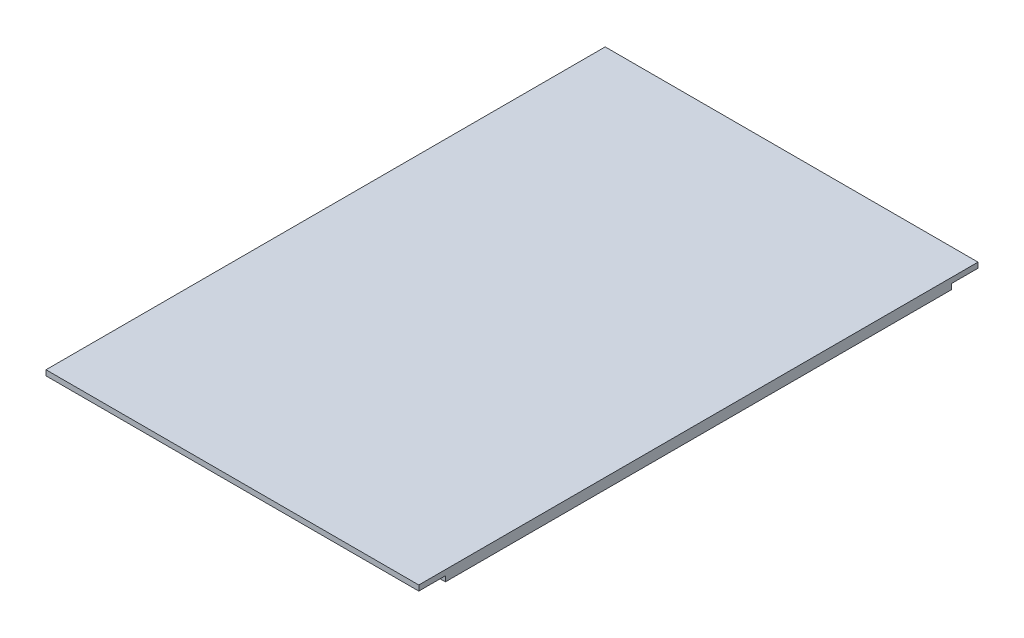
ISO-10303-21;
HEADER;
FILE_DESCRIPTION(('STEP AP214'),'2;1');
FILE_NAME('part.step','',(''),(''),'','','');
FILE_SCHEMA(('AUTOMOTIVE_DESIGN { 1 0 10303 214 1 1 1 1 }'));
ENDSEC;
DATA;
#1=APPLICATION_CONTEXT('core data for automotive mechanical design processes');
#2=APPLICATION_PROTOCOL_DEFINITION('international standard','automotive_design',2000,#1);
#3=PRODUCT_CONTEXT('',#1,'mechanical');
#4=PRODUCT('Part','Part','',(#3));
#5=PRODUCT_RELATED_PRODUCT_CATEGORY('part','',(#4));
#6=PRODUCT_DEFINITION_FORMATION('','',#4);
#7=PRODUCT_DEFINITION_CONTEXT('part definition',#1,'design');
#8=PRODUCT_DEFINITION('design','',#6,#7);
#9=PRODUCT_DEFINITION_SHAPE('','',#8);
#10=(LENGTH_UNIT() NAMED_UNIT(*) SI_UNIT(.MILLI.,.METRE.));
#11=(NAMED_UNIT(*) PLANE_ANGLE_UNIT() SI_UNIT($,.RADIAN.));
#12=(NAMED_UNIT(*) SI_UNIT($,.STERADIAN.) SOLID_ANGLE_UNIT());
#13=UNCERTAINTY_MEASURE_WITH_UNIT(LENGTH_MEASURE(1.E-05),#10,'distance_accuracy_value','');
#14=(GEOMETRIC_REPRESENTATION_CONTEXT(3) GLOBAL_UNCERTAINTY_ASSIGNED_CONTEXT((#13)) GLOBAL_UNIT_ASSIGNED_CONTEXT((#10,
#11,#12)) REPRESENTATION_CONTEXT('',''));
#15=CARTESIAN_POINT('',(0.,0.,0.));
#16=DIRECTION('',(0.,0.,1.));
#17=DIRECTION('',(1.,0.,0.));
#18=AXIS2_PLACEMENT_3D('',#15,#16,#17);
#19=CARTESIAN_POINT('',(0.,29.,-95.));
#20=DIRECTION('',(0.,0.,-1.));
#21=DIRECTION('',(-1.,0.,0.));
#22=AXIS2_PLACEMENT_3D('',#19,#20,#21);
#23=PLANE('',#22);
#24=DIRECTION('',(0.,-1.,0.));
#25=VECTOR('',#24,1.);
#26=CARTESIAN_POINT('',(-70.,29.,-95.));
#27=LINE('',#26,#25);
#28=CARTESIAN_POINT('',(-70.,2.,-95.));
#29=VERTEX_POINT('',#28);
#30=CARTESIAN_POINT('',(-70.,0.,-95.));
#31=VERTEX_POINT('',#30);
#32=EDGE_CURVE('E166',#29,#31,#27,.T.);
#33=ORIENTED_EDGE('',*,*,#32,.F.);
#34=DIRECTION('',(1.,0.,0.));
#35=VECTOR('',#34,1.);
#36=CARTESIAN_POINT('',(-70.,2.,-95.));
#37=LINE('',#36,#35);
#38=CARTESIAN_POINT('',(70.,2.00000000000001,-95.));
#39=VERTEX_POINT('',#38);
#40=EDGE_CURVE('E149',#29,#39,#37,.T.);
#41=ORIENTED_EDGE('',*,*,#40,.T.);
#42=DIRECTION('',(0.,-1.,0.));
#43=VECTOR('',#42,1.);
#44=CARTESIAN_POINT('',(70.,29.,-95.));
#45=LINE('',#44,#43);
#46=CARTESIAN_POINT('',(70.,0.,-95.));
#47=VERTEX_POINT('',#46);
#48=EDGE_CURVE('E176',#39,#47,#45,.T.);
#49=ORIENTED_EDGE('',*,*,#48,.T.);
#50=DIRECTION('',(-1.,0.,0.));
#51=VECTOR('',#50,1.);
#52=CARTESIAN_POINT('',(0.,0.,-95.));
#53=LINE('',#52,#51);
#54=EDGE_CURVE('E52',#47,#31,#53,.T.);
#55=ORIENTED_EDGE('',*,*,#54,.T.);
#56=EDGE_LOOP('',(#33,#41,#49,#55));
#57=FACE_BOUND('',#56,.T.);
#58=ADVANCED_FACE('F43',(#57),#23,.T.);
#59=CARTESIAN_POINT('',(0.,4.,0.));
#60=DIRECTION('',(0.,1.,0.));
#61=DIRECTION('',(0.,0.,1.));
#62=AXIS2_PLACEMENT_3D('',#59,#60,#61);
#63=PLANE('',#62);
#64=DIRECTION('',(0.,0.,1.));
#65=VECTOR('',#64,1.);
#66=CARTESIAN_POINT('',(-70.,4.,-210.));
#67=LINE('',#66,#65);
#68=CARTESIAN_POINT('',(-70.,4.,-105.));
#69=VERTEX_POINT('',#68);
#70=CARTESIAN_POINT('',(-70.,4.,105.));
#71=VERTEX_POINT('',#70);
#72=EDGE_CURVE('E184',#69,#71,#67,.T.);
#73=ORIENTED_EDGE('',*,*,#72,.T.);
#74=DIRECTION('',(1.,0.,0.));
#75=VECTOR('',#74,1.);
#76=CARTESIAN_POINT('',(-70.,4.,105.));
#77=LINE('',#76,#75);
#78=CARTESIAN_POINT('',(70.,4.,105.));
#79=VERTEX_POINT('',#78);
#80=EDGE_CURVE('E118',#71,#79,#77,.T.);
#81=ORIENTED_EDGE('',*,*,#80,.T.);
#82=DIRECTION('',(0.,0.,-1.));
#83=VECTOR('',#82,1.);
#84=CARTESIAN_POINT('',(70.,4.,-210.));
#85=LINE('',#84,#83);
#86=CARTESIAN_POINT('',(70.,4.,-105.));
#87=VERTEX_POINT('',#86);
#88=EDGE_CURVE('E181',#79,#87,#85,.T.);
#89=ORIENTED_EDGE('',*,*,#88,.T.);
#90=DIRECTION('',(-1.,0.,0.));
#91=VECTOR('',#90,1.);
#92=CARTESIAN_POINT('',(-70.,4.,-105.));
#93=LINE('',#92,#91);
#94=EDGE_CURVE('E143',#87,#69,#93,.T.);
#95=ORIENTED_EDGE('',*,*,#94,.T.);
#96=EDGE_LOOP('',(#73,#81,#89,#95));
#97=FACE_BOUND('',#96,.T.);
#98=ADVANCED_FACE('F223',(#97),#63,.T.);
#99=CARTESIAN_POINT('',(70.,4.,-210.));
#100=DIRECTION('',(-1.,0.,0.));
#101=DIRECTION('',(0.,0.,1.));
#102=AXIS2_PLACEMENT_3D('',#99,#100,#101);
#103=PLANE('',#102);
#104=ORIENTED_EDGE('',*,*,#88,.F.);
#105=DIRECTION('',(0.,1.,0.));
#106=VECTOR('',#105,1.);
#107=CARTESIAN_POINT('',(70.,2.,105.));
#108=LINE('',#107,#106);
#109=CARTESIAN_POINT('',(70.,2.,105.));
#110=VERTEX_POINT('',#109);
#111=EDGE_CURVE('E121',#110,#79,#108,.T.);
#112=ORIENTED_EDGE('',*,*,#111,.F.);
#113=DIRECTION('',(0.,0.,-1.));
#114=VECTOR('',#113,1.);
#115=CARTESIAN_POINT('',(70.,2.,94.9999999999999));
#116=LINE('',#115,#114);
#117=CARTESIAN_POINT('',(70.,2.,94.9999999999999));
#118=VERTEX_POINT('',#117);
#119=EDGE_CURVE('E126',#110,#118,#116,.T.);
#120=ORIENTED_EDGE('',*,*,#119,.T.);
#121=DIRECTION('',(0.,-1.,0.));
#122=VECTOR('',#121,1.);
#123=CARTESIAN_POINT('',(70.,29.,94.9999999999999));
#124=LINE('',#123,#122);
#125=CARTESIAN_POINT('',(70.,0.,94.9999999999999));
#126=VERTEX_POINT('',#125);
#127=EDGE_CURVE('E170',#118,#126,#124,.T.);
#128=ORIENTED_EDGE('',*,*,#127,.T.);
#129=DIRECTION('',(0.,0.,-1.));
#130=VECTOR('',#129,1.);
#131=CARTESIAN_POINT('',(70.,0.,-210.));
#132=LINE('',#131,#130);
#133=EDGE_CURVE('E173',#126,#47,#132,.T.);
#134=ORIENTED_EDGE('',*,*,#133,.T.);
#135=ORIENTED_EDGE('',*,*,#48,.F.);
#136=DIRECTION('',(0.,0.,-1.));
#137=VECTOR('',#136,1.);
#138=CARTESIAN_POINT('',(70.,2.,-95.));
#139=LINE('',#138,#137);
#140=CARTESIAN_POINT('',(70.,2.,-105.));
#141=VERTEX_POINT('',#140);
#142=EDGE_CURVE('E67',#39,#141,#139,.T.);
#143=ORIENTED_EDGE('',*,*,#142,.T.);
#144=DIRECTION('',(0.,1.,0.));
#145=VECTOR('',#144,1.);
#146=CARTESIAN_POINT('',(70.,2.,-105.));
#147=LINE('',#146,#145);
#148=EDGE_CURVE('E158',#141,#87,#147,.T.);
#149=ORIENTED_EDGE('',*,*,#148,.T.);
#150=EDGE_LOOP('',(#104,#112,#120,#128,#134,#135,#143,#149));
#151=FACE_BOUND('',#150,.T.);
#152=ADVANCED_FACE('F45',(#151),#103,.F.);
#153=CARTESIAN_POINT('',(-70.,4.,-210.));
#154=DIRECTION('',(1.,0.,0.));
#155=DIRECTION('',(0.,0.,-1.));
#156=AXIS2_PLACEMENT_3D('',#153,#154,#155);
#157=PLANE('',#156);
#158=DIRECTION('',(0.,0.,1.));
#159=VECTOR('',#158,1.);
#160=CARTESIAN_POINT('',(-70.,0.,-210.));
#161=LINE('',#160,#159);
#162=CARTESIAN_POINT('',(-70.,0.,94.9999999999999));
#163=VERTEX_POINT('',#162);
#164=EDGE_CURVE('E185',#31,#163,#161,.T.);
#165=ORIENTED_EDGE('',*,*,#164,.T.);
#166=DIRECTION('',(0.,-1.,0.));
#167=VECTOR('',#166,1.);
#168=CARTESIAN_POINT('',(-70.,29.,94.9999999999999));
#169=LINE('',#168,#167);
#170=CARTESIAN_POINT('',(-70.,2.00000000000001,94.9999999999999));
#171=VERTEX_POINT('',#170);
#172=EDGE_CURVE('E132',#171,#163,#169,.T.);
#173=ORIENTED_EDGE('',*,*,#172,.F.);
#174=DIRECTION('',(0.,0.,1.));
#175=VECTOR('',#174,1.);
#176=CARTESIAN_POINT('',(-70.,2.,94.9999999999999));
#177=LINE('',#176,#175);
#178=CARTESIAN_POINT('',(-70.,2.,105.));
#179=VERTEX_POINT('',#178);
#180=EDGE_CURVE('E59',#171,#179,#177,.T.);
#181=ORIENTED_EDGE('',*,*,#180,.T.);
#182=DIRECTION('',(0.,1.,0.));
#183=VECTOR('',#182,1.);
#184=CARTESIAN_POINT('',(-70.,2.,105.));
#185=LINE('',#184,#183);
#186=EDGE_CURVE('E113',#179,#71,#185,.T.);
#187=ORIENTED_EDGE('',*,*,#186,.T.);
#188=ORIENTED_EDGE('',*,*,#72,.F.);
#189=DIRECTION('',(0.,1.,0.));
#190=VECTOR('',#189,1.);
#191=CARTESIAN_POINT('',(-70.,2.,-105.));
#192=LINE('',#191,#190);
#193=CARTESIAN_POINT('',(-70.,2.,-105.));
#194=VERTEX_POINT('',#193);
#195=EDGE_CURVE('E162',#194,#69,#192,.T.);
#196=ORIENTED_EDGE('',*,*,#195,.F.);
#197=DIRECTION('',(0.,0.,1.));
#198=VECTOR('',#197,1.);
#199=CARTESIAN_POINT('',(-70.,2.,-95.));
#200=LINE('',#199,#198);
#201=EDGE_CURVE('E145',#194,#29,#200,.T.);
#202=ORIENTED_EDGE('',*,*,#201,.T.);
#203=ORIENTED_EDGE('',*,*,#32,.T.);
#204=EDGE_LOOP('',(#165,#173,#181,#187,#188,#196,#202,#203));
#205=FACE_BOUND('',#204,.T.);
#206=ADVANCED_FACE('F131',(#205),#157,.F.);
#207=CARTESIAN_POINT('',(0.,0.,0.));
#208=DIRECTION('',(0.,1.,0.));
#209=DIRECTION('',(0.,0.,1.));
#210=AXIS2_PLACEMENT_3D('',#207,#208,#209);
#211=PLANE('',#210);
#212=ORIENTED_EDGE('',*,*,#133,.F.);
#213=DIRECTION('',(-1.,0.,0.));
#214=VECTOR('',#213,1.);
#215=CARTESIAN_POINT('',(0.,0.,94.9999999999999));
#216=LINE('',#215,#214);
#217=EDGE_CURVE('E11',#126,#163,#216,.T.);
#218=ORIENTED_EDGE('',*,*,#217,.T.);
#219=ORIENTED_EDGE('',*,*,#164,.F.);
#220=ORIENTED_EDGE('',*,*,#54,.F.);
#221=EDGE_LOOP('',(#212,#218,#219,#220));
#222=FACE_BOUND('',#221,.T.);
#223=ADVANCED_FACE('F201',(#222),#211,.F.);
#224=CARTESIAN_POINT('',(0.,29.,94.9999999999999));
#225=DIRECTION('',(0.,0.,-1.));
#226=DIRECTION('',(-1.,0.,0.));
#227=AXIS2_PLACEMENT_3D('',#224,#225,#226);
#228=PLANE('',#227);
#229=ORIENTED_EDGE('',*,*,#127,.F.);
#230=DIRECTION('',(-1.,0.,0.));
#231=VECTOR('',#230,1.);
#232=CARTESIAN_POINT('',(-70.,2.,94.9999999999999));
#233=LINE('',#232,#231);
#234=EDGE_CURVE('E122',#118,#171,#233,.T.);
#235=ORIENTED_EDGE('',*,*,#234,.T.);
#236=ORIENTED_EDGE('',*,*,#172,.T.);
#237=ORIENTED_EDGE('',*,*,#217,.F.);
#238=EDGE_LOOP('',(#229,#235,#236,#237));
#239=FACE_BOUND('',#238,.T.);
#240=ADVANCED_FACE('F211',(#239),#228,.F.);
#241=CARTESIAN_POINT('',(-70.,2.,-105.));
#242=DIRECTION('',(0.,0.,-1.));
#243=DIRECTION('',(-1.,0.,0.));
#244=AXIS2_PLACEMENT_3D('',#241,#242,#243);
#245=PLANE('',#244);
#246=ORIENTED_EDGE('',*,*,#94,.F.);
#247=ORIENTED_EDGE('',*,*,#148,.F.);
#248=DIRECTION('',(-1.,0.,0.));
#249=VECTOR('',#248,1.);
#250=CARTESIAN_POINT('',(-70.,2.,-105.));
#251=LINE('',#250,#249);
#252=EDGE_CURVE('E154',#141,#194,#251,.T.);
#253=ORIENTED_EDGE('',*,*,#252,.T.);
#254=ORIENTED_EDGE('',*,*,#195,.T.);
#255=EDGE_LOOP('',(#246,#247,#253,#254));
#256=FACE_BOUND('',#255,.T.);
#257=ADVANCED_FACE('F207',(#256),#245,.T.);
#258=CARTESIAN_POINT('',(0.,2.,0.));
#259=DIRECTION('',(0.,-1.,0.));
#260=DIRECTION('',(0.,0.,-1.));
#261=AXIS2_PLACEMENT_3D('',#258,#259,#260);
#262=PLANE('',#261);
#263=ORIENTED_EDGE('',*,*,#201,.F.);
#264=ORIENTED_EDGE('',*,*,#252,.F.);
#265=ORIENTED_EDGE('',*,*,#142,.F.);
#266=ORIENTED_EDGE('',*,*,#40,.F.);
#267=EDGE_LOOP('',(#263,#264,#265,#266));
#268=FACE_BOUND('',#267,.T.);
#269=ADVANCED_FACE('F204',(#268),#262,.T.);
#270=CARTESIAN_POINT('',(-70.,2.,105.));
#271=DIRECTION('',(0.,0.,1.));
#272=DIRECTION('',(1.,0.,0.));
#273=AXIS2_PLACEMENT_3D('',#270,#271,#272);
#274=PLANE('',#273);
#275=ORIENTED_EDGE('',*,*,#80,.F.);
#276=ORIENTED_EDGE('',*,*,#186,.F.);
#277=DIRECTION('',(1.,0.,0.));
#278=VECTOR('',#277,1.);
#279=CARTESIAN_POINT('',(-70.,2.,105.));
#280=LINE('',#279,#278);
#281=EDGE_CURVE('E116',#179,#110,#280,.T.);
#282=ORIENTED_EDGE('',*,*,#281,.T.);
#283=ORIENTED_EDGE('',*,*,#111,.T.);
#284=EDGE_LOOP('',(#275,#276,#282,#283));
#285=FACE_BOUND('',#284,.T.);
#286=ADVANCED_FACE('F114',(#285),#274,.T.);
#287=CARTESIAN_POINT('',(0.,2.,0.));
#288=DIRECTION('',(0.,1.,0.));
#289=DIRECTION('',(0.,0.,1.));
#290=AXIS2_PLACEMENT_3D('',#287,#288,#289);
#291=PLANE('',#290);
#292=ORIENTED_EDGE('',*,*,#180,.F.);
#293=ORIENTED_EDGE('',*,*,#234,.F.);
#294=ORIENTED_EDGE('',*,*,#119,.F.);
#295=ORIENTED_EDGE('',*,*,#281,.F.);
#296=EDGE_LOOP('',(#292,#293,#294,#295));
#297=FACE_BOUND('',#296,.T.);
#298=ADVANCED_FACE('F125',(#297),#291,.F.);
#299=CLOSED_SHELL('',(#58,#98,#152,#206,#223,#240,#257,#269,#286,#298));
#300=MANIFOLD_SOLID_BREP('B2',#299);
#301=ADVANCED_BREP_SHAPE_REPRESENTATION('',(#18,#300),#14);
#302=SHAPE_DEFINITION_REPRESENTATION(#9,#301);
ENDSEC;
END-ISO-10303-21;
